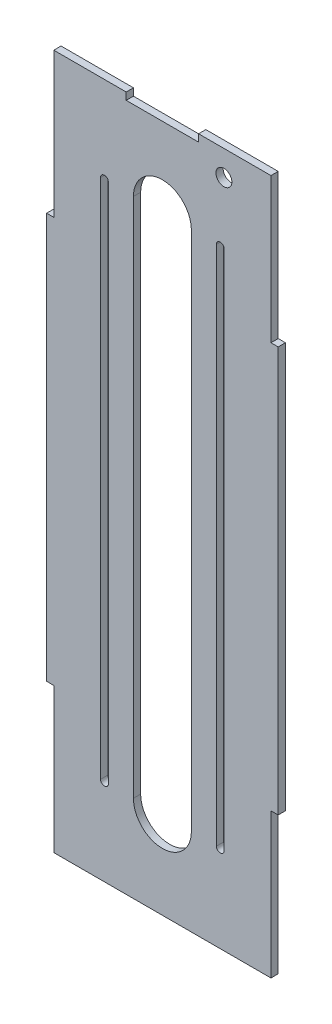
ISO-10303-21;
HEADER;
FILE_DESCRIPTION(('STEP AP214'),'2;1');
FILE_NAME('part.step','',(''),(''),'','','');
FILE_SCHEMA(('AUTOMOTIVE_DESIGN { 1 0 10303 214 1 1 1 1 }'));
ENDSEC;
DATA;
#1=APPLICATION_CONTEXT('core data for automotive mechanical design processes');
#2=APPLICATION_PROTOCOL_DEFINITION('international standard','automotive_design',2000,#1);
#3=PRODUCT_CONTEXT('',#1,'mechanical');
#4=PRODUCT('Part','Part','',(#3));
#5=PRODUCT_RELATED_PRODUCT_CATEGORY('part','',(#4));
#6=PRODUCT_DEFINITION_FORMATION('','',#4);
#7=PRODUCT_DEFINITION_CONTEXT('part definition',#1,'design');
#8=PRODUCT_DEFINITION('design','',#6,#7);
#9=PRODUCT_DEFINITION_SHAPE('','',#8);
#10=(LENGTH_UNIT() NAMED_UNIT(*) SI_UNIT(.MILLI.,.METRE.));
#11=(NAMED_UNIT(*) PLANE_ANGLE_UNIT() SI_UNIT($,.RADIAN.));
#12=(NAMED_UNIT(*) SI_UNIT($,.STERADIAN.) SOLID_ANGLE_UNIT());
#13=UNCERTAINTY_MEASURE_WITH_UNIT(LENGTH_MEASURE(1.E-05),#10,'distance_accuracy_value','');
#14=(GEOMETRIC_REPRESENTATION_CONTEXT(3) GLOBAL_UNCERTAINTY_ASSIGNED_CONTEXT((#13)) GLOBAL_UNIT_ASSIGNED_CONTEXT((#10,
#11,#12)) REPRESENTATION_CONTEXT('',''));
#15=CARTESIAN_POINT('',(0.,0.,0.));
#16=DIRECTION('',(0.,0.,1.));
#17=DIRECTION('',(1.,0.,0.));
#18=AXIS2_PLACEMENT_3D('',#15,#16,#17);
#19=CARTESIAN_POINT('',(0.,0.,6.35));
#20=DIRECTION('',(0.,0.,1.));
#21=DIRECTION('',(1.,0.,0.));
#22=AXIS2_PLACEMENT_3D('',#19,#20,#21);
#23=PLANE('',#22);
#24=CARTESIAN_POINT('',(-857.158491521162,652.784891730796,6.35));
#25=DIRECTION('',(0.,0.,1.));
#26=DIRECTION('',(1.,0.,0.));
#27=AXIS2_PLACEMENT_3D('',#24,#25,#26);
#28=CIRCLE('',#27,6.98500000000007);
#29=CARTESIAN_POINT('',(-850.173491521162,652.784891730796,6.35));
#30=VERTEX_POINT('',#29);
#31=EDGE_CURVE('E239',#30,#30,#28,.T.);
#32=ORIENTED_EDGE('',*,*,#31,.F.);
#33=EDGE_LOOP('',(#32));
#34=FACE_BOUND('',#33,.T.);
#35=CARTESIAN_POINT('',(-961.926767394614,141.508550967699,6.35));
#36=DIRECTION('',(0.,0.,-1.));
#37=DIRECTION('',(-1.,0.,0.));
#38=AXIS2_PLACEMENT_3D('',#35,#36,#37);
#39=CIRCLE('',#38,3.42900000000002);
#40=CARTESIAN_POINT('',(-958.497767394614,141.508550967699,6.35));
#41=VERTEX_POINT('',#40);
#42=CARTESIAN_POINT('',(-965.355767394614,141.508550967699,6.35));
#43=VERTEX_POINT('',#42);
#44=EDGE_CURVE('E256',#41,#43,#39,.T.);
#45=ORIENTED_EDGE('',*,*,#44,.T.);
#46=DIRECTION('',(0.,1.,0.));
#47=VECTOR('',#46,1.);
#48=CARTESIAN_POINT('',(-965.355767394614,141.508550967699,6.35));
#49=LINE('',#48,#47);
#50=CARTESIAN_POINT('',(-965.355767394614,598.708550967699,6.35));
#51=VERTEX_POINT('',#50);
#52=EDGE_CURVE('E259',#43,#51,#49,.T.);
#53=ORIENTED_EDGE('',*,*,#52,.T.);
#54=CARTESIAN_POINT('',(-961.926767394614,598.708550967699,6.35));
#55=DIRECTION('',(0.,0.,-1.));
#56=DIRECTION('',(-1.,0.,0.));
#57=AXIS2_PLACEMENT_3D('',#54,#55,#56);
#58=CIRCLE('',#57,3.42900000000002);
#59=CARTESIAN_POINT('',(-958.497767394614,598.708550967699,6.35));
#60=VERTEX_POINT('',#59);
#61=EDGE_CURVE('E263',#51,#60,#58,.T.);
#62=ORIENTED_EDGE('',*,*,#61,.T.);
#63=DIRECTION('',(0.,1.,0.));
#64=VECTOR('',#63,1.);
#65=CARTESIAN_POINT('',(-958.497767394614,141.508550967699,6.35));
#66=LINE('',#65,#64);
#67=EDGE_CURVE('E266',#41,#60,#66,.T.);
#68=ORIENTED_EDGE('',*,*,#67,.F.);
#69=EDGE_LOOP('',(#45,#53,#62,#68));
#70=FACE_BOUND('',#69,.T.);
#71=CARTESIAN_POINT('',(-911.126767394614,141.508550967699,6.35));
#72=DIRECTION('',(0.,0.,1.));
#73=DIRECTION('',(1.,0.,0.));
#74=AXIS2_PLACEMENT_3D('',#71,#72,#73);
#75=CIRCLE('',#74,25.4);
#76=CARTESIAN_POINT('',(-936.526767394614,141.508550967699,6.35));
#77=VERTEX_POINT('',#76);
#78=CARTESIAN_POINT('',(-885.726767394614,141.508550967699,6.35));
#79=VERTEX_POINT('',#78);
#80=EDGE_CURVE('E366',#77,#79,#75,.T.);
#81=ORIENTED_EDGE('',*,*,#80,.F.);
#82=DIRECTION('',(0.,1.,0.));
#83=VECTOR('',#82,1.);
#84=CARTESIAN_POINT('',(-936.526767394614,141.508550967699,6.35));
#85=LINE('',#84,#83);
#86=CARTESIAN_POINT('',(-936.526767394614,598.708550967699,6.35));
#87=VERTEX_POINT('',#86);
#88=EDGE_CURVE('E371',#77,#87,#85,.T.);
#89=ORIENTED_EDGE('',*,*,#88,.T.);
#90=CARTESIAN_POINT('',(-911.126767394614,598.708550967699,6.35));
#91=DIRECTION('',(0.,0.,1.));
#92=DIRECTION('',(1.,0.,0.));
#93=AXIS2_PLACEMENT_3D('',#90,#91,#92);
#94=CIRCLE('',#93,25.4);
#95=CARTESIAN_POINT('',(-885.726767394614,598.708550967699,6.35));
#96=VERTEX_POINT('',#95);
#97=EDGE_CURVE('E384',#96,#87,#94,.T.);
#98=ORIENTED_EDGE('',*,*,#97,.F.);
#99=DIRECTION('',(0.,1.,0.));
#100=VECTOR('',#99,1.);
#101=CARTESIAN_POINT('',(-885.726767394614,141.508550967699,6.35));
#102=LINE('',#101,#100);
#103=EDGE_CURVE('E381',#79,#96,#102,.T.);
#104=ORIENTED_EDGE('',*,*,#103,.F.);
#105=EDGE_LOOP('',(#81,#89,#98,#104));
#106=FACE_BOUND('',#105,.T.);
#107=DIRECTION('',(-1.,0.,0.));
#108=VECTOR('',#107,1.);
#109=CARTESIAN_POINT('',(-803.176767394614,674.908550967699,6.35));
#110=LINE('',#109,#108);
#111=CARTESIAN_POINT('',(-815.876767394614,674.908550967699,6.35));
#112=VERTEX_POINT('',#111);
#113=CARTESIAN_POINT('',(-879.376767394614,674.908550967699,6.35));
#114=VERTEX_POINT('',#113);
#115=EDGE_CURVE('E402',#112,#114,#110,.T.);
#116=ORIENTED_EDGE('',*,*,#115,.T.);
#117=DIRECTION('',(0.,-1.,0.));
#118=VECTOR('',#117,1.);
#119=CARTESIAN_POINT('',(-879.376767394614,0.,6.35));
#120=LINE('',#119,#118);
#121=CARTESIAN_POINT('',(-879.376767394614,668.558550967699,6.35));
#122=VERTEX_POINT('',#121);
#123=EDGE_CURVE('E301',#114,#122,#120,.T.);
#124=ORIENTED_EDGE('',*,*,#123,.T.);
#125=DIRECTION('',(-1.,0.,0.));
#126=VECTOR('',#125,1.);
#127=CARTESIAN_POINT('',(0.,668.558550967699,6.35));
#128=LINE('',#127,#126);
#129=CARTESIAN_POINT('',(-942.876767394614,668.558550967699,6.35));
#130=VERTEX_POINT('',#129);
#131=EDGE_CURVE('E303',#122,#130,#128,.T.);
#132=ORIENTED_EDGE('',*,*,#131,.T.);
#133=DIRECTION('',(0.,1.,0.));
#134=VECTOR('',#133,1.);
#135=CARTESIAN_POINT('',(-942.876767394614,0.,6.35));
#136=LINE('',#135,#134);
#137=CARTESIAN_POINT('',(-942.876767394614,674.908550967699,6.34999999999997));
#138=VERTEX_POINT('',#137);
#139=EDGE_CURVE('E295',#130,#138,#136,.T.);
#140=ORIENTED_EDGE('',*,*,#139,.T.);
#141=CARTESIAN_POINT('',(-1006.37676739461,674.908550967699,6.34999999999997));
#142=VERTEX_POINT('',#141);
#143=EDGE_CURVE('E400',#138,#142,#110,.T.);
#144=ORIENTED_EDGE('',*,*,#143,.T.);
#145=DIRECTION('',(0.,1.,0.));
#146=VECTOR('',#145,1.);
#147=CARTESIAN_POINT('',(-1006.37676739461,0.,6.35));
#148=LINE('',#147,#146);
#149=CARTESIAN_POINT('',(-1006.37676739461,547.908550967699,6.34999999999997));
#150=VERTEX_POINT('',#149);
#151=EDGE_CURVE('E343',#150,#142,#148,.T.);
#152=ORIENTED_EDGE('',*,*,#151,.F.);
#153=DIRECTION('',(1.,0.,0.));
#154=VECTOR('',#153,1.);
#155=CARTESIAN_POINT('',(0.,547.908550967699,6.35));
#156=LINE('',#155,#154);
#157=CARTESIAN_POINT('',(-1012.72676739461,547.908550967699,6.34999999999997));
#158=VERTEX_POINT('',#157);
#159=EDGE_CURVE('E341',#158,#150,#156,.T.);
#160=ORIENTED_EDGE('',*,*,#159,.F.);
#161=DIRECTION('',(0.,-1.,0.));
#162=VECTOR('',#161,1.);
#163=CARTESIAN_POINT('',(-1012.72676739461,0.,6.35));
#164=LINE('',#163,#162);
#165=CARTESIAN_POINT('',(-1012.72676739461,192.308550967699,6.34999999999997));
#166=VERTEX_POINT('',#165);
#167=EDGE_CURVE('E317',#158,#166,#164,.T.);
#168=ORIENTED_EDGE('',*,*,#167,.T.);
#169=DIRECTION('',(1.,0.,0.));
#170=VECTOR('',#169,1.);
#171=CARTESIAN_POINT('',(0.,192.308550967699,6.35));
#172=LINE('',#171,#170);
#173=CARTESIAN_POINT('',(-1006.37676739461,192.308550967699,6.35));
#174=VERTEX_POINT('',#173);
#175=EDGE_CURVE('E331',#166,#174,#172,.T.);
#176=ORIENTED_EDGE('',*,*,#175,.T.);
#177=DIRECTION('',(0.,-1.,0.));
#178=VECTOR('',#177,1.);
#179=CARTESIAN_POINT('',(-1006.37676739461,0.,6.35));
#180=LINE('',#179,#178);
#181=CARTESIAN_POINT('',(-1006.37676739461,65.3085509676989,6.34999999999997));
#182=VERTEX_POINT('',#181);
#183=EDGE_CURVE('E326',#174,#182,#180,.T.);
#184=ORIENTED_EDGE('',*,*,#183,.T.);
#185=DIRECTION('',(1.,0.,0.));
#186=VECTOR('',#185,1.);
#187=CARTESIAN_POINT('',(-803.176767394614,65.3085509676989,6.35));
#188=LINE('',#187,#186);
#189=CARTESIAN_POINT('',(-815.876767394614,65.3085509676989,6.35));
#190=VERTEX_POINT('',#189);
#191=EDGE_CURVE('E398',#182,#190,#188,.T.);
#192=ORIENTED_EDGE('',*,*,#191,.T.);
#193=DIRECTION('',(0.,-1.,0.));
#194=VECTOR('',#193,1.);
#195=CARTESIAN_POINT('',(-815.876767394614,0.,6.35));
#196=LINE('',#195,#194);
#197=CARTESIAN_POINT('',(-815.876767394614,192.308550967699,6.34999999999997));
#198=VERTEX_POINT('',#197);
#199=EDGE_CURVE('E352',#198,#190,#196,.T.);
#200=ORIENTED_EDGE('',*,*,#199,.F.);
#201=DIRECTION('',(-1.,0.,0.));
#202=VECTOR('',#201,1.);
#203=CARTESIAN_POINT('',(4.20286183300467E-13,192.308550967697,6.35));
#204=LINE('',#203,#202);
#205=CARTESIAN_POINT('',(-809.526767394614,192.308550967699,6.35));
#206=VERTEX_POINT('',#205);
#207=EDGE_CURVE('E355',#206,#198,#204,.T.);
#208=ORIENTED_EDGE('',*,*,#207,.F.);
#209=DIRECTION('',(0.,-1.,0.));
#210=VECTOR('',#209,1.);
#211=CARTESIAN_POINT('',(-809.526767394614,0.,6.35));
#212=LINE('',#211,#210);
#213=CARTESIAN_POINT('',(-809.526767394614,547.908550967699,6.34999999999997));
#214=VERTEX_POINT('',#213);
#215=EDGE_CURVE('E311',#214,#206,#212,.T.);
#216=ORIENTED_EDGE('',*,*,#215,.F.);
#217=DIRECTION('',(-1.,0.,0.));
#218=VECTOR('',#217,1.);
#219=CARTESIAN_POINT('',(0.,547.908550967699,6.35));
#220=LINE('',#219,#218);
#221=CARTESIAN_POINT('',(-815.876767394614,547.908550967699,6.35));
#222=VERTEX_POINT('',#221);
#223=EDGE_CURVE('E362',#214,#222,#220,.T.);
#224=ORIENTED_EDGE('',*,*,#223,.T.);
#225=DIRECTION('',(0.,1.,0.));
#226=VECTOR('',#225,1.);
#227=CARTESIAN_POINT('',(-815.876767394614,0.,6.35));
#228=LINE('',#227,#226);
#229=EDGE_CURVE('E364',#222,#112,#228,.T.);
#230=ORIENTED_EDGE('',*,*,#229,.T.);
#231=EDGE_LOOP('',(#116,#124,#132,#140,#144,#152,#160,#168,#176,#184,#192,#200,#208,#216,#224,#230));
#232=FACE_BOUND('',#231,.T.);
#233=DIRECTION('',(0.,1.,0.));
#234=VECTOR('',#233,1.);
#235=CARTESIAN_POINT('',(-856.897767394614,141.508550967699,6.35));
#236=LINE('',#235,#234);
#237=CARTESIAN_POINT('',(-856.897767394614,141.508550967699,6.35));
#238=VERTEX_POINT('',#237);
#239=CARTESIAN_POINT('',(-856.897767394614,598.708550967699,6.35));
#240=VERTEX_POINT('',#239);
#241=EDGE_CURVE('E223',#238,#240,#236,.T.);
#242=ORIENTED_EDGE('',*,*,#241,.F.);
#243=CARTESIAN_POINT('',(-860.326767394614,141.508550967699,6.35));
#244=DIRECTION('',(0.,0.,1.));
#245=DIRECTION('',(1.,0.,0.));
#246=AXIS2_PLACEMENT_3D('',#243,#244,#245);
#247=CIRCLE('',#246,3.42900000000002);
#248=CARTESIAN_POINT('',(-863.755767394614,141.508550967699,6.35));
#249=VERTEX_POINT('',#248);
#250=EDGE_CURVE('E220',#249,#238,#247,.T.);
#251=ORIENTED_EDGE('',*,*,#250,.F.);
#252=DIRECTION('',(0.,1.,0.));
#253=VECTOR('',#252,1.);
#254=CARTESIAN_POINT('',(-863.755767394614,141.508550967699,6.35));
#255=LINE('',#254,#253);
#256=CARTESIAN_POINT('',(-863.755767394615,598.708550967699,6.35));
#257=VERTEX_POINT('',#256);
#258=EDGE_CURVE('E226',#249,#257,#255,.T.);
#259=ORIENTED_EDGE('',*,*,#258,.T.);
#260=CARTESIAN_POINT('',(-860.326767394614,598.708550967699,6.35));
#261=DIRECTION('',(0.,0.,1.));
#262=DIRECTION('',(1.,0.,0.));
#263=AXIS2_PLACEMENT_3D('',#260,#261,#262);
#264=CIRCLE('',#263,3.42900000000002);
#265=EDGE_CURVE('E230',#240,#257,#264,.T.);
#266=ORIENTED_EDGE('',*,*,#265,.F.);
#267=EDGE_LOOP('',(#242,#251,#259,#266));
#268=FACE_BOUND('',#267,.T.);
#269=ADVANCED_FACE('F33',(#34,#70,#106,#232,#268),#23,.T.);
#270=CARTESIAN_POINT('',(0.,0.,0.));
#271=DIRECTION('',(0.,0.,1.));
#272=DIRECTION('',(1.,0.,0.));
#273=AXIS2_PLACEMENT_3D('',#270,#271,#272);
#274=PLANE('',#273);
#275=CARTESIAN_POINT('',(-857.158491521162,652.784891730796,0.));
#276=DIRECTION('',(0.,0.,1.));
#277=DIRECTION('',(1.,0.,0.));
#278=AXIS2_PLACEMENT_3D('',#275,#276,#277);
#279=CIRCLE('',#278,6.98500000000007);
#280=CARTESIAN_POINT('',(-850.173491521162,652.784891730796,0.));
#281=VERTEX_POINT('',#280);
#282=EDGE_CURVE('E246',#281,#281,#279,.T.);
#283=ORIENTED_EDGE('',*,*,#282,.T.);
#284=EDGE_LOOP('',(#283));
#285=FACE_BOUND('',#284,.T.);
#286=DIRECTION('',(0.,-1.,0.));
#287=VECTOR('',#286,1.);
#288=CARTESIAN_POINT('',(-879.376767394614,0.,0.));
#289=LINE('',#288,#287);
#290=CARTESIAN_POINT('',(-879.376767394614,674.908550967699,0.));
#291=VERTEX_POINT('',#290);
#292=CARTESIAN_POINT('',(-879.376767394614,668.558550967699,0.));
#293=VERTEX_POINT('',#292);
#294=EDGE_CURVE('E298',#291,#293,#289,.T.);
#295=ORIENTED_EDGE('',*,*,#294,.F.);
#296=DIRECTION('',(-1.,0.,0.));
#297=VECTOR('',#296,1.);
#298=CARTESIAN_POINT('',(-803.176767394614,674.908550967699,0.));
#299=LINE('',#298,#297);
#300=CARTESIAN_POINT('',(-815.876767394614,674.908550967699,0.));
#301=VERTEX_POINT('',#300);
#302=EDGE_CURVE('E401',#301,#291,#299,.T.);
#303=ORIENTED_EDGE('',*,*,#302,.F.);
#304=DIRECTION('',(0.,1.,0.));
#305=VECTOR('',#304,1.);
#306=CARTESIAN_POINT('',(-815.876767394614,0.,0.));
#307=LINE('',#306,#305);
#308=CARTESIAN_POINT('',(-815.876767394614,547.908550967699,0.));
#309=VERTEX_POINT('',#308);
#310=EDGE_CURVE('E411',#309,#301,#307,.T.);
#311=ORIENTED_EDGE('',*,*,#310,.F.);
#312=DIRECTION('',(-1.,0.,0.));
#313=VECTOR('',#312,1.);
#314=CARTESIAN_POINT('',(0.,547.908550967699,0.));
#315=LINE('',#314,#313);
#316=CARTESIAN_POINT('',(-809.526767394614,547.908550967699,0.));
#317=VERTEX_POINT('',#316);
#318=EDGE_CURVE('E405',#317,#309,#315,.T.);
#319=ORIENTED_EDGE('',*,*,#318,.F.);
#320=DIRECTION('',(0.,-1.,0.));
#321=VECTOR('',#320,1.);
#322=CARTESIAN_POINT('',(-809.526767394614,0.,0.));
#323=LINE('',#322,#321);
#324=CARTESIAN_POINT('',(-809.526767394614,192.308550967699,0.));
#325=VERTEX_POINT('',#324);
#326=EDGE_CURVE('E308',#317,#325,#323,.T.);
#327=ORIENTED_EDGE('',*,*,#326,.T.);
#328=DIRECTION('',(-1.,0.,0.));
#329=VECTOR('',#328,1.);
#330=CARTESIAN_POINT('',(4.20286183300467E-13,192.308550967697,0.));
#331=LINE('',#330,#329);
#332=CARTESIAN_POINT('',(-815.876767394614,192.308550967699,0.));
#333=VERTEX_POINT('',#332);
#334=EDGE_CURVE('E417',#325,#333,#331,.T.);
#335=ORIENTED_EDGE('',*,*,#334,.T.);
#336=DIRECTION('',(0.,-1.,0.));
#337=VECTOR('',#336,1.);
#338=CARTESIAN_POINT('',(-815.876767394614,0.,0.));
#339=LINE('',#338,#337);
#340=CARTESIAN_POINT('',(-815.876767394614,65.3085509676989,0.));
#341=VERTEX_POINT('',#340);
#342=EDGE_CURVE('E349',#333,#341,#339,.T.);
#343=ORIENTED_EDGE('',*,*,#342,.T.);
#344=DIRECTION('',(1.,0.,0.));
#345=VECTOR('',#344,1.);
#346=CARTESIAN_POINT('',(-803.176767394614,65.3085509676989,0.));
#347=LINE('',#346,#345);
#348=CARTESIAN_POINT('',(-1006.37676739461,65.3085509676989,0.));
#349=VERTEX_POINT('',#348);
#350=EDGE_CURVE('E391',#349,#341,#347,.T.);
#351=ORIENTED_EDGE('',*,*,#350,.F.);
#352=DIRECTION('',(0.,-1.,0.));
#353=VECTOR('',#352,1.);
#354=CARTESIAN_POINT('',(-1006.37676739461,0.,0.));
#355=LINE('',#354,#353);
#356=CARTESIAN_POINT('',(-1006.37676739461,192.308550967699,0.));
#357=VERTEX_POINT('',#356);
#358=EDGE_CURVE('E323',#357,#349,#355,.T.);
#359=ORIENTED_EDGE('',*,*,#358,.F.);
#360=DIRECTION('',(1.,0.,0.));
#361=VECTOR('',#360,1.);
#362=CARTESIAN_POINT('',(0.,192.308550967699,0.));
#363=LINE('',#362,#361);
#364=CARTESIAN_POINT('',(-1012.72676739461,192.308550967699,0.));
#365=VERTEX_POINT('',#364);
#366=EDGE_CURVE('E329',#365,#357,#363,.T.);
#367=ORIENTED_EDGE('',*,*,#366,.F.);
#368=DIRECTION('',(0.,-1.,0.));
#369=VECTOR('',#368,1.);
#370=CARTESIAN_POINT('',(-1012.72676739461,0.,0.));
#371=LINE('',#370,#369);
#372=CARTESIAN_POINT('',(-1012.72676739461,547.908550967699,0.));
#373=VERTEX_POINT('',#372);
#374=EDGE_CURVE('E315',#373,#365,#371,.T.);
#375=ORIENTED_EDGE('',*,*,#374,.F.);
#376=DIRECTION('',(1.,0.,0.));
#377=VECTOR('',#376,1.);
#378=CARTESIAN_POINT('',(0.,547.908550967699,0.));
#379=LINE('',#378,#377);
#380=CARTESIAN_POINT('',(-1006.37676739461,547.908550967699,0.));
#381=VERTEX_POINT('',#380);
#382=EDGE_CURVE('E339',#373,#381,#379,.T.);
#383=ORIENTED_EDGE('',*,*,#382,.T.);
#384=DIRECTION('',(0.,1.,0.));
#385=VECTOR('',#384,1.);
#386=CARTESIAN_POINT('',(-1006.37676739461,0.,0.));
#387=LINE('',#386,#385);
#388=CARTESIAN_POINT('',(-1006.37676739461,674.908550967699,0.));
#389=VERTEX_POINT('',#388);
#390=EDGE_CURVE('E419',#381,#389,#387,.T.);
#391=ORIENTED_EDGE('',*,*,#390,.T.);
#392=CARTESIAN_POINT('',(-942.876767394614,674.908550967699,0.));
#393=VERTEX_POINT('',#392);
#394=EDGE_CURVE('E407',#393,#389,#299,.T.);
#395=ORIENTED_EDGE('',*,*,#394,.F.);
#396=DIRECTION('',(0.,1.,0.));
#397=VECTOR('',#396,1.);
#398=CARTESIAN_POINT('',(-942.876767394614,0.,0.));
#399=LINE('',#398,#397);
#400=CARTESIAN_POINT('',(-942.876767394614,668.558550967699,0.));
#401=VERTEX_POINT('',#400);
#402=EDGE_CURVE('E292',#401,#393,#399,.T.);
#403=ORIENTED_EDGE('',*,*,#402,.F.);
#404=DIRECTION('',(-1.,0.,0.));
#405=VECTOR('',#404,1.);
#406=CARTESIAN_POINT('',(0.,668.558550967699,0.));
#407=LINE('',#406,#405);
#408=EDGE_CURVE('E11',#293,#401,#407,.T.);
#409=ORIENTED_EDGE('',*,*,#408,.F.);
#410=EDGE_LOOP('',(#295,#303,#311,#319,#327,#335,#343,#351,#359,#367,#375,#383,#391,#395,#403,#409));
#411=FACE_BOUND('',#410,.T.);
#412=DIRECTION('',(0.,1.,0.));
#413=VECTOR('',#412,1.);
#414=CARTESIAN_POINT('',(-936.526767394614,141.508550967699,0.));
#415=LINE('',#414,#413);
#416=CARTESIAN_POINT('',(-936.526767394614,141.508550967699,0.));
#417=VERTEX_POINT('',#416);
#418=CARTESIAN_POINT('',(-936.526767394614,598.708550967699,0.));
#419=VERTEX_POINT('',#418);
#420=EDGE_CURVE('E377',#417,#419,#415,.T.);
#421=ORIENTED_EDGE('',*,*,#420,.F.);
#422=CARTESIAN_POINT('',(-911.126767394614,141.508550967699,0.));
#423=DIRECTION('',(0.,0.,1.));
#424=DIRECTION('',(1.,0.,0.));
#425=AXIS2_PLACEMENT_3D('',#422,#423,#424);
#426=CIRCLE('',#425,25.4);
#427=CARTESIAN_POINT('',(-885.726767394614,141.508550967699,0.));
#428=VERTEX_POINT('',#427);
#429=EDGE_CURVE('E367',#417,#428,#426,.T.);
#430=ORIENTED_EDGE('',*,*,#429,.T.);
#431=DIRECTION('',(0.,1.,0.));
#432=VECTOR('',#431,1.);
#433=CARTESIAN_POINT('',(-885.726767394614,141.508550967699,0.));
#434=LINE('',#433,#432);
#435=CARTESIAN_POINT('',(-885.726767394614,598.708550967699,0.));
#436=VERTEX_POINT('',#435);
#437=EDGE_CURVE('E370',#428,#436,#434,.T.);
#438=ORIENTED_EDGE('',*,*,#437,.T.);
#439=CARTESIAN_POINT('',(-911.126767394614,598.708550967699,0.));
#440=DIRECTION('',(0.,0.,1.));
#441=DIRECTION('',(1.,0.,0.));
#442=AXIS2_PLACEMENT_3D('',#439,#440,#441);
#443=CIRCLE('',#442,25.4);
#444=EDGE_CURVE('E374',#436,#419,#443,.T.);
#445=ORIENTED_EDGE('',*,*,#444,.T.);
#446=EDGE_LOOP('',(#421,#430,#438,#445));
#447=FACE_BOUND('',#446,.T.);
#448=DIRECTION('',(0.,1.,0.));
#449=VECTOR('',#448,1.);
#450=CARTESIAN_POINT('',(-965.355767394614,141.508550967699,0.));
#451=LINE('',#450,#449);
#452=CARTESIAN_POINT('',(-965.355767394614,141.508550967699,0.));
#453=VERTEX_POINT('',#452);
#454=CARTESIAN_POINT('',(-965.355767394614,598.708550967699,0.));
#455=VERTEX_POINT('',#454);
#456=EDGE_CURVE('E270',#453,#455,#451,.T.);
#457=ORIENTED_EDGE('',*,*,#456,.F.);
#458=CARTESIAN_POINT('',(-961.926767394614,141.508550967699,0.));
#459=DIRECTION('',(0.,0.,-1.));
#460=DIRECTION('',(-1.,0.,0.));
#461=AXIS2_PLACEMENT_3D('',#458,#459,#460);
#462=CIRCLE('',#461,3.42900000000002);
#463=CARTESIAN_POINT('',(-958.497767394614,141.508550967699,0.));
#464=VERTEX_POINT('',#463);
#465=EDGE_CURVE('E252',#464,#453,#462,.T.);
#466=ORIENTED_EDGE('',*,*,#465,.F.);
#467=DIRECTION('',(0.,1.,0.));
#468=VECTOR('',#467,1.);
#469=CARTESIAN_POINT('',(-958.497767394614,141.508550967699,0.));
#470=LINE('',#469,#468);
#471=CARTESIAN_POINT('',(-958.497767394614,598.708550967699,0.));
#472=VERTEX_POINT('',#471);
#473=EDGE_CURVE('E260',#464,#472,#470,.T.);
#474=ORIENTED_EDGE('',*,*,#473,.T.);
#475=CARTESIAN_POINT('',(-961.926767394614,598.708550967699,0.));
#476=DIRECTION('',(0.,0.,-1.));
#477=DIRECTION('',(-1.,0.,0.));
#478=AXIS2_PLACEMENT_3D('',#475,#476,#477);
#479=CIRCLE('',#478,3.42900000000002);
#480=EDGE_CURVE('E273',#455,#472,#479,.T.);
#481=ORIENTED_EDGE('',*,*,#480,.F.);
#482=EDGE_LOOP('',(#457,#466,#474,#481));
#483=FACE_BOUND('',#482,.T.);
#484=CARTESIAN_POINT('',(-860.326767394614,141.508550967699,0.));
#485=DIRECTION('',(0.,0.,1.));
#486=DIRECTION('',(1.,0.,0.));
#487=AXIS2_PLACEMENT_3D('',#484,#485,#486);
#488=CIRCLE('',#487,3.42900000000002);
#489=CARTESIAN_POINT('',(-863.755767394614,141.508550967699,0.));
#490=VERTEX_POINT('',#489);
#491=CARTESIAN_POINT('',(-856.897767394614,141.508550967699,0.));
#492=VERTEX_POINT('',#491);
#493=EDGE_CURVE('E56',#490,#492,#488,.T.);
#494=ORIENTED_EDGE('',*,*,#493,.T.);
#495=DIRECTION('',(0.,1.,0.));
#496=VECTOR('',#495,1.);
#497=CARTESIAN_POINT('',(-856.897767394614,141.508550967699,0.));
#498=LINE('',#497,#496);
#499=CARTESIAN_POINT('',(-856.897767394614,598.708550967699,0.));
#500=VERTEX_POINT('',#499);
#501=EDGE_CURVE('E233',#492,#500,#498,.T.);
#502=ORIENTED_EDGE('',*,*,#501,.T.);
#503=CARTESIAN_POINT('',(-860.326767394614,598.708550967699,0.));
#504=DIRECTION('',(0.,0.,1.));
#505=DIRECTION('',(1.,0.,0.));
#506=AXIS2_PLACEMENT_3D('',#503,#504,#505);
#507=CIRCLE('',#506,3.42900000000002);
#508=CARTESIAN_POINT('',(-863.755767394615,598.708550967699,0.));
#509=VERTEX_POINT('',#508);
#510=EDGE_CURVE('E236',#500,#509,#507,.T.);
#511=ORIENTED_EDGE('',*,*,#510,.T.);
#512=DIRECTION('',(0.,1.,0.));
#513=VECTOR('',#512,1.);
#514=CARTESIAN_POINT('',(-863.755767394614,141.508550967699,0.));
#515=LINE('',#514,#513);
#516=EDGE_CURVE('E245',#490,#509,#515,.T.);
#517=ORIENTED_EDGE('',*,*,#516,.F.);
#518=EDGE_LOOP('',(#494,#502,#511,#517));
#519=FACE_BOUND('',#518,.T.);
#520=ADVANCED_FACE('F456',(#285,#411,#447,#483,#519),#274,.F.);
#521=CARTESIAN_POINT('',(-803.176767394614,674.908550967699,6.35));
#522=DIRECTION('',(0.,-1.,0.));
#523=DIRECTION('',(0.,0.,-1.));
#524=AXIS2_PLACEMENT_3D('',#521,#522,#523);
#525=PLANE('',#524);
#526=DIRECTION('',(0.,0.,-1.));
#527=VECTOR('',#526,1.);
#528=CARTESIAN_POINT('',(-879.376767394614,674.908550967699,6.35));
#529=LINE('',#528,#527);
#530=EDGE_CURVE('E41',#114,#291,#529,.T.);
#531=ORIENTED_EDGE('',*,*,#530,.F.);
#532=ORIENTED_EDGE('',*,*,#115,.F.);
#533=DIRECTION('',(0.,0.,-1.));
#534=VECTOR('',#533,1.);
#535=CARTESIAN_POINT('',(-815.876767394614,674.908550967699,822.705411436437));
#536=LINE('',#535,#534);
#537=EDGE_CURVE('E360',#112,#301,#536,.T.);
#538=ORIENTED_EDGE('',*,*,#537,.T.);
#539=ORIENTED_EDGE('',*,*,#302,.T.);
#540=EDGE_LOOP('',(#531,#532,#538,#539));
#541=FACE_BOUND('',#540,.T.);
#542=ADVANCED_FACE('F440',(#541),#525,.F.);
#543=DIRECTION('',(0.,0.,1.));
#544=VECTOR('',#543,1.);
#545=CARTESIAN_POINT('',(-942.876767394614,674.908550967699,6.35));
#546=LINE('',#545,#544);
#547=EDGE_CURVE('E431',#393,#138,#546,.T.);
#548=ORIENTED_EDGE('',*,*,#547,.F.);
#549=ORIENTED_EDGE('',*,*,#394,.T.);
#550=DIRECTION('',(0.,0.,-1.));
#551=VECTOR('',#550,1.);
#552=CARTESIAN_POINT('',(-1006.37676739461,674.908550967699,814.767911436436));
#553=LINE('',#552,#551);
#554=EDGE_CURVE('E336',#142,#389,#553,.T.);
#555=ORIENTED_EDGE('',*,*,#554,.F.);
#556=ORIENTED_EDGE('',*,*,#143,.F.);
#557=EDGE_LOOP('',(#548,#549,#555,#556));
#558=FACE_BOUND('',#557,.T.);
#559=ADVANCED_FACE('F473',(#558),#525,.F.);
#560=CARTESIAN_POINT('',(-1006.37676739461,547.908550967699,814.767911436436));
#561=DIRECTION('',(0.,-1.,0.));
#562=DIRECTION('',(0.,0.,-1.));
#563=AXIS2_PLACEMENT_3D('',#560,#561,#562);
#564=PLANE('',#563);
#565=DIRECTION('',(0.,0.,-1.));
#566=VECTOR('',#565,1.);
#567=CARTESIAN_POINT('',(-1012.72676739461,547.908550967699,814.767911436436));
#568=LINE('',#567,#566);
#569=EDGE_CURVE('E313',#158,#373,#568,.T.);
#570=ORIENTED_EDGE('',*,*,#569,.F.);
#571=ORIENTED_EDGE('',*,*,#159,.T.);
#572=DIRECTION('',(0.,0.,-1.));
#573=VECTOR('',#572,1.);
#574=CARTESIAN_POINT('',(-1006.37676739461,547.908550967699,814.767911436436));
#575=LINE('',#574,#573);
#576=EDGE_CURVE('E333',#150,#381,#575,.T.);
#577=ORIENTED_EDGE('',*,*,#576,.T.);
#578=ORIENTED_EDGE('',*,*,#382,.F.);
#579=EDGE_LOOP('',(#570,#571,#577,#578));
#580=FACE_BOUND('',#579,.T.);
#581=ADVANCED_FACE('F478',(#580),#564,.F.);
#582=CARTESIAN_POINT('',(-1006.37676739461,192.308550967699,814.767911436436));
#583=DIRECTION('',(0.,-1.,0.));
#584=DIRECTION('',(0.,0.,-1.));
#585=AXIS2_PLACEMENT_3D('',#582,#583,#584);
#586=PLANE('',#585);
#587=ORIENTED_EDGE('',*,*,#175,.F.);
#588=DIRECTION('',(0.,0.,-1.));
#589=VECTOR('',#588,1.);
#590=CARTESIAN_POINT('',(-1012.72676739461,192.308550967699,814.767911436436));
#591=LINE('',#590,#589);
#592=EDGE_CURVE('E425',#166,#365,#591,.T.);
#593=ORIENTED_EDGE('',*,*,#592,.T.);
#594=ORIENTED_EDGE('',*,*,#366,.T.);
#595=DIRECTION('',(0.,0.,-1.));
#596=VECTOR('',#595,1.);
#597=CARTESIAN_POINT('',(-1006.37676739461,192.308550967699,814.767911436436));
#598=LINE('',#597,#596);
#599=EDGE_CURVE('E320',#174,#357,#598,.T.);
#600=ORIENTED_EDGE('',*,*,#599,.F.);
#601=EDGE_LOOP('',(#587,#593,#594,#600));
#602=FACE_BOUND('',#601,.T.);
#603=ADVANCED_FACE('F484',(#602),#586,.T.);
#604=CARTESIAN_POINT('',(-803.176767394614,65.3085509676989,6.35));
#605=DIRECTION('',(0.,1.,0.));
#606=DIRECTION('',(0.,0.,1.));
#607=AXIS2_PLACEMENT_3D('',#604,#605,#606);
#608=PLANE('',#607);
#609=DIRECTION('',(0.,0.,1.));
#610=VECTOR('',#609,1.);
#611=CARTESIAN_POINT('',(-1006.37676739461,65.3085509676989,6.35));
#612=LINE('',#611,#610);
#613=EDGE_CURVE('E422',#349,#182,#612,.T.);
#614=ORIENTED_EDGE('',*,*,#613,.F.);
#615=ORIENTED_EDGE('',*,*,#350,.T.);
#616=DIRECTION('',(0.,0.,1.));
#617=VECTOR('',#616,1.);
#618=CARTESIAN_POINT('',(-815.876767394614,65.3085509676989,6.35));
#619=LINE('',#618,#617);
#620=EDGE_CURVE('E414',#341,#190,#619,.T.);
#621=ORIENTED_EDGE('',*,*,#620,.T.);
#622=ORIENTED_EDGE('',*,*,#191,.F.);
#623=EDGE_LOOP('',(#614,#615,#621,#622));
#624=FACE_BOUND('',#623,.T.);
#625=ADVANCED_FACE('F35',(#624),#608,.F.);
#626=CARTESIAN_POINT('',(-911.126767394614,141.508550967699,0.));
#627=DIRECTION('',(0.,0.,1.));
#628=DIRECTION('',(1.,0.,0.));
#629=AXIS2_PLACEMENT_3D('',#626,#627,#628);
#630=CYLINDRICAL_SURFACE('',#629,25.4);
#631=ORIENTED_EDGE('',*,*,#80,.T.);
#632=DIRECTION('',(0.,0.,1.));
#633=VECTOR('',#632,1.);
#634=CARTESIAN_POINT('',(-885.726767394614,141.508550967699,0.));
#635=LINE('',#634,#633);
#636=EDGE_CURVE('E379',#428,#79,#635,.T.);
#637=ORIENTED_EDGE('',*,*,#636,.F.);
#638=ORIENTED_EDGE('',*,*,#429,.F.);
#639=DIRECTION('',(0.,0.,1.));
#640=VECTOR('',#639,1.);
#641=CARTESIAN_POINT('',(-936.526767394614,141.508550967699,0.));
#642=LINE('',#641,#640);
#643=EDGE_CURVE('E389',#417,#77,#642,.T.);
#644=ORIENTED_EDGE('',*,*,#643,.T.);
#645=EDGE_LOOP('',(#631,#637,#638,#644));
#646=FACE_BOUND('',#645,.T.);
#647=ADVANCED_FACE('F525',(#646),#630,.F.);
#648=CARTESIAN_POINT('',(-936.526767394614,141.508550967699,0.));
#649=DIRECTION('',(1.,0.,0.));
#650=DIRECTION('',(0.,1.,0.));
#651=AXIS2_PLACEMENT_3D('',#648,#649,#650);
#652=PLANE('',#651);
#653=ORIENTED_EDGE('',*,*,#88,.F.);
#654=ORIENTED_EDGE('',*,*,#643,.F.);
#655=ORIENTED_EDGE('',*,*,#420,.T.);
#656=DIRECTION('',(0.,0.,1.));
#657=VECTOR('',#656,1.);
#658=CARTESIAN_POINT('',(-936.526767394614,598.708550967699,0.));
#659=LINE('',#658,#657);
#660=EDGE_CURVE('E392',#419,#87,#659,.T.);
#661=ORIENTED_EDGE('',*,*,#660,.T.);
#662=EDGE_LOOP('',(#653,#654,#655,#661));
#663=FACE_BOUND('',#662,.T.);
#664=ADVANCED_FACE('F554',(#663),#652,.T.);
#665=CARTESIAN_POINT('',(-911.126767394614,598.708550967699,0.));
#666=DIRECTION('',(0.,0.,1.));
#667=DIRECTION('',(1.,0.,0.));
#668=AXIS2_PLACEMENT_3D('',#665,#666,#667);
#669=CYLINDRICAL_SURFACE('',#668,25.4);
#670=ORIENTED_EDGE('',*,*,#97,.T.);
#671=ORIENTED_EDGE('',*,*,#660,.F.);
#672=ORIENTED_EDGE('',*,*,#444,.F.);
#673=DIRECTION('',(0.,0.,1.));
#674=VECTOR('',#673,1.);
#675=CARTESIAN_POINT('',(-885.726767394614,598.708550967699,0.));
#676=LINE('',#675,#674);
#677=EDGE_CURVE('E394',#436,#96,#676,.T.);
#678=ORIENTED_EDGE('',*,*,#677,.T.);
#679=EDGE_LOOP('',(#670,#671,#672,#678));
#680=FACE_BOUND('',#679,.T.);
#681=ADVANCED_FACE('F557',(#680),#669,.F.);
#682=CARTESIAN_POINT('',(-885.726767394614,141.508550967699,0.));
#683=DIRECTION('',(1.,0.,0.));
#684=DIRECTION('',(0.,1.,0.));
#685=AXIS2_PLACEMENT_3D('',#682,#683,#684);
#686=PLANE('',#685);
#687=ORIENTED_EDGE('',*,*,#103,.T.);
#688=ORIENTED_EDGE('',*,*,#677,.F.);
#689=ORIENTED_EDGE('',*,*,#437,.F.);
#690=ORIENTED_EDGE('',*,*,#636,.T.);
#691=EDGE_LOOP('',(#687,#688,#689,#690));
#692=FACE_BOUND('',#691,.T.);
#693=ADVANCED_FACE('F553',(#692),#686,.F.);
#694=CARTESIAN_POINT('',(-815.876767394614,674.908550967699,822.705411436437));
#695=DIRECTION('',(1.,0.,0.));
#696=DIRECTION('',(0.,0.,-1.));
#697=AXIS2_PLACEMENT_3D('',#694,#695,#696);
#698=PLANE('',#697);
#699=ORIENTED_EDGE('',*,*,#229,.F.);
#700=DIRECTION('',(0.,0.,-1.));
#701=VECTOR('',#700,1.);
#702=CARTESIAN_POINT('',(-815.876767394614,547.908550967699,822.705411436437));
#703=LINE('',#702,#701);
#704=EDGE_CURVE('E357',#222,#309,#703,.T.);
#705=ORIENTED_EDGE('',*,*,#704,.T.);
#706=ORIENTED_EDGE('',*,*,#310,.T.);
#707=ORIENTED_EDGE('',*,*,#537,.F.);
#708=EDGE_LOOP('',(#699,#705,#706,#707));
#709=FACE_BOUND('',#708,.T.);
#710=ADVANCED_FACE('F450',(#709),#698,.T.);
#711=CARTESIAN_POINT('',(-815.876767394614,547.908550967699,822.705411436437));
#712=DIRECTION('',(0.,1.,0.));
#713=DIRECTION('',(0.,0.,1.));
#714=AXIS2_PLACEMENT_3D('',#711,#712,#713);
#715=PLANE('',#714);
#716=DIRECTION('',(0.,0.,-1.));
#717=VECTOR('',#716,1.);
#718=CARTESIAN_POINT('',(-809.526767394614,547.908550967699,812.152865353866));
#719=LINE('',#718,#717);
#720=EDGE_CURVE('E305',#214,#317,#719,.T.);
#721=ORIENTED_EDGE('',*,*,#720,.T.);
#722=ORIENTED_EDGE('',*,*,#318,.T.);
#723=ORIENTED_EDGE('',*,*,#704,.F.);
#724=ORIENTED_EDGE('',*,*,#223,.F.);
#725=EDGE_LOOP('',(#721,#722,#723,#724));
#726=FACE_BOUND('',#725,.T.);
#727=ADVANCED_FACE('F452',(#726),#715,.T.);
#728=CARTESIAN_POINT('',(-815.876767394614,192.308550967699,814.767911436436));
#729=DIRECTION('',(0.,1.,0.));
#730=DIRECTION('',(-1.,0.,0.));
#731=AXIS2_PLACEMENT_3D('',#728,#729,#730);
#732=PLANE('',#731);
#733=ORIENTED_EDGE('',*,*,#334,.F.);
#734=DIRECTION('',(0.,0.,1.));
#735=VECTOR('',#734,1.);
#736=CARTESIAN_POINT('',(-809.526767394614,192.308550967699,814.767911436436));
#737=LINE('',#736,#735);
#738=EDGE_CURVE('E428',#325,#206,#737,.T.);
#739=ORIENTED_EDGE('',*,*,#738,.T.);
#740=ORIENTED_EDGE('',*,*,#207,.T.);
#741=DIRECTION('',(0.,0.,-1.));
#742=VECTOR('',#741,1.);
#743=CARTESIAN_POINT('',(-815.876767394614,192.308550967699,814.767911436436));
#744=LINE('',#743,#742);
#745=EDGE_CURVE('E346',#198,#333,#744,.T.);
#746=ORIENTED_EDGE('',*,*,#745,.T.);
#747=EDGE_LOOP('',(#733,#739,#740,#746));
#748=FACE_BOUND('',#747,.T.);
#749=ADVANCED_FACE('F500',(#748),#732,.F.);
#750=CARTESIAN_POINT('',(-815.876767394614,65.3085509676989,814.767911436436));
#751=DIRECTION('',(-1.,0.,0.));
#752=DIRECTION('',(0.,0.,1.));
#753=AXIS2_PLACEMENT_3D('',#750,#751,#752);
#754=PLANE('',#753);
#755=ORIENTED_EDGE('',*,*,#745,.F.);
#756=ORIENTED_EDGE('',*,*,#199,.T.);
#757=ORIENTED_EDGE('',*,*,#620,.F.);
#758=ORIENTED_EDGE('',*,*,#342,.F.);
#759=EDGE_LOOP('',(#755,#756,#757,#758));
#760=FACE_BOUND('',#759,.T.);
#761=ADVANCED_FACE('F495',(#760),#754,.F.);
#762=CARTESIAN_POINT('',(-1006.37676739461,674.908550967699,814.767911436436));
#763=DIRECTION('',(1.,0.,0.));
#764=DIRECTION('',(0.,0.,-1.));
#765=AXIS2_PLACEMENT_3D('',#762,#763,#764);
#766=PLANE('',#765);
#767=ORIENTED_EDGE('',*,*,#576,.F.);
#768=ORIENTED_EDGE('',*,*,#151,.T.);
#769=ORIENTED_EDGE('',*,*,#554,.T.);
#770=ORIENTED_EDGE('',*,*,#390,.F.);
#771=EDGE_LOOP('',(#767,#768,#769,#770));
#772=FACE_BOUND('',#771,.T.);
#773=ADVANCED_FACE('F471',(#772),#766,.F.);
#774=CARTESIAN_POINT('',(-1006.37676739461,65.3085509676989,814.767911436436));
#775=DIRECTION('',(-1.,0.,0.));
#776=DIRECTION('',(0.,0.,1.));
#777=AXIS2_PLACEMENT_3D('',#774,#775,#776);
#778=PLANE('',#777);
#779=ORIENTED_EDGE('',*,*,#183,.F.);
#780=ORIENTED_EDGE('',*,*,#599,.T.);
#781=ORIENTED_EDGE('',*,*,#358,.T.);
#782=ORIENTED_EDGE('',*,*,#613,.T.);
#783=EDGE_LOOP('',(#779,#780,#781,#782));
#784=FACE_BOUND('',#783,.T.);
#785=ADVANCED_FACE('F488',(#784),#778,.T.);
#786=CARTESIAN_POINT('',(-1012.72676739461,192.308550967699,814.767911436436));
#787=DIRECTION('',(-1.,0.,0.));
#788=DIRECTION('',(0.,0.,1.));
#789=AXIS2_PLACEMENT_3D('',#786,#787,#788);
#790=PLANE('',#789);
#791=ORIENTED_EDGE('',*,*,#167,.F.);
#792=ORIENTED_EDGE('',*,*,#569,.T.);
#793=ORIENTED_EDGE('',*,*,#374,.T.);
#794=ORIENTED_EDGE('',*,*,#592,.F.);
#795=EDGE_LOOP('',(#791,#792,#793,#794));
#796=FACE_BOUND('',#795,.T.);
#797=ADVANCED_FACE('F504',(#796),#790,.T.);
#798=CARTESIAN_POINT('',(-809.526767394614,192.308550967699,812.152865353866));
#799=DIRECTION('',(-1.,0.,0.));
#800=DIRECTION('',(0.,0.,1.));
#801=AXIS2_PLACEMENT_3D('',#798,#799,#800);
#802=PLANE('',#801);
#803=ORIENTED_EDGE('',*,*,#720,.F.);
#804=ORIENTED_EDGE('',*,*,#215,.T.);
#805=ORIENTED_EDGE('',*,*,#738,.F.);
#806=ORIENTED_EDGE('',*,*,#326,.F.);
#807=EDGE_LOOP('',(#803,#804,#805,#806));
#808=FACE_BOUND('',#807,.T.);
#809=ADVANCED_FACE('F502',(#808),#802,.F.);
#810=CARTESIAN_POINT('',(-942.876767394614,668.558550967699,-811.195244379878));
#811=DIRECTION('',(0.,1.,0.));
#812=DIRECTION('',(0.,0.,1.));
#813=AXIS2_PLACEMENT_3D('',#810,#811,#812);
#814=PLANE('',#813);
#815=ORIENTED_EDGE('',*,*,#131,.F.);
#816=DIRECTION('',(0.,0.,1.));
#817=VECTOR('',#816,1.);
#818=CARTESIAN_POINT('',(-879.376767394614,668.558550967699,-811.195244379878));
#819=LINE('',#818,#817);
#820=EDGE_CURVE('E289',#293,#122,#819,.T.);
#821=ORIENTED_EDGE('',*,*,#820,.F.);
#822=ORIENTED_EDGE('',*,*,#408,.T.);
#823=DIRECTION('',(0.,0.,1.));
#824=VECTOR('',#823,1.);
#825=CARTESIAN_POINT('',(-942.876767394614,668.558550967699,-811.195244379878));
#826=LINE('',#825,#824);
#827=EDGE_CURVE('E280',#401,#130,#826,.T.);
#828=ORIENTED_EDGE('',*,*,#827,.T.);
#829=EDGE_LOOP('',(#815,#821,#822,#828));
#830=FACE_BOUND('',#829,.T.);
#831=ADVANCED_FACE('F461',(#830),#814,.T.);
#832=CARTESIAN_POINT('',(-879.376767394614,668.558550967699,-811.195244379878));
#833=DIRECTION('',(-1.,0.,0.));
#834=DIRECTION('',(0.,0.,1.));
#835=AXIS2_PLACEMENT_3D('',#832,#833,#834);
#836=PLANE('',#835);
#837=ORIENTED_EDGE('',*,*,#123,.F.);
#838=ORIENTED_EDGE('',*,*,#530,.T.);
#839=ORIENTED_EDGE('',*,*,#294,.T.);
#840=ORIENTED_EDGE('',*,*,#820,.T.);
#841=EDGE_LOOP('',(#837,#838,#839,#840));
#842=FACE_BOUND('',#841,.T.);
#843=ADVANCED_FACE('F436',(#842),#836,.T.);
#844=CARTESIAN_POINT('',(-942.876767394614,668.558550967699,-811.195244379878));
#845=DIRECTION('',(1.,0.,0.));
#846=DIRECTION('',(0.,0.,-1.));
#847=AXIS2_PLACEMENT_3D('',#844,#845,#846);
#848=PLANE('',#847);
#849=ORIENTED_EDGE('',*,*,#139,.F.);
#850=ORIENTED_EDGE('',*,*,#827,.F.);
#851=ORIENTED_EDGE('',*,*,#402,.T.);
#852=ORIENTED_EDGE('',*,*,#547,.T.);
#853=EDGE_LOOP('',(#849,#850,#851,#852));
#854=FACE_BOUND('',#853,.T.);
#855=ADVANCED_FACE('F464',(#854),#848,.T.);
#856=CARTESIAN_POINT('',(-961.926767394614,141.508550967699,6.35));
#857=DIRECTION('',(0.,0.,-1.));
#858=DIRECTION('',(-1.,0.,0.));
#859=AXIS2_PLACEMENT_3D('',#856,#857,#858);
#860=CYLINDRICAL_SURFACE('',#859,3.42900000000002);
#861=ORIENTED_EDGE('',*,*,#465,.T.);
#862=DIRECTION('',(0.,0.,-1.));
#863=VECTOR('',#862,1.);
#864=CARTESIAN_POINT('',(-965.355767394614,141.508550967699,6.35));
#865=LINE('',#864,#863);
#866=EDGE_CURVE('E268',#43,#453,#865,.T.);
#867=ORIENTED_EDGE('',*,*,#866,.F.);
#868=ORIENTED_EDGE('',*,*,#44,.F.);
#869=DIRECTION('',(0.,0.,-1.));
#870=VECTOR('',#869,1.);
#871=CARTESIAN_POINT('',(-958.497767394614,141.508550967699,6.35));
#872=LINE('',#871,#870);
#873=EDGE_CURVE('E278',#41,#464,#872,.T.);
#874=ORIENTED_EDGE('',*,*,#873,.T.);
#875=EDGE_LOOP('',(#861,#867,#868,#874));
#876=FACE_BOUND('',#875,.T.);
#877=ADVANCED_FACE('F656',(#876),#860,.F.);
#878=CARTESIAN_POINT('',(-958.497767394614,141.508550967699,6.35));
#879=DIRECTION('',(-1.,0.,0.));
#880=DIRECTION('',(0.,-1.,0.));
#881=AXIS2_PLACEMENT_3D('',#878,#879,#880);
#882=PLANE('',#881);
#883=ORIENTED_EDGE('',*,*,#473,.F.);
#884=ORIENTED_EDGE('',*,*,#873,.F.);
#885=ORIENTED_EDGE('',*,*,#67,.T.);
#886=DIRECTION('',(0.,0.,-1.));
#887=VECTOR('',#886,1.);
#888=CARTESIAN_POINT('',(-958.497767394614,598.708550967699,6.35));
#889=LINE('',#888,#887);
#890=EDGE_CURVE('E281',#60,#472,#889,.T.);
#891=ORIENTED_EDGE('',*,*,#890,.T.);
#892=EDGE_LOOP('',(#883,#884,#885,#891));
#893=FACE_BOUND('',#892,.T.);
#894=ADVANCED_FACE('F664',(#893),#882,.T.);
#895=CARTESIAN_POINT('',(-961.926767394614,598.708550967699,6.35));
#896=DIRECTION('',(0.,0.,-1.));
#897=DIRECTION('',(-1.,0.,0.));
#898=AXIS2_PLACEMENT_3D('',#895,#896,#897);
#899=CYLINDRICAL_SURFACE('',#898,3.42900000000002);
#900=ORIENTED_EDGE('',*,*,#480,.T.);
#901=ORIENTED_EDGE('',*,*,#890,.F.);
#902=ORIENTED_EDGE('',*,*,#61,.F.);
#903=DIRECTION('',(0.,0.,-1.));
#904=VECTOR('',#903,1.);
#905=CARTESIAN_POINT('',(-965.355767394614,598.708550967699,6.35));
#906=LINE('',#905,#904);
#907=EDGE_CURVE('E283',#51,#455,#906,.T.);
#908=ORIENTED_EDGE('',*,*,#907,.T.);
#909=EDGE_LOOP('',(#900,#901,#902,#908));
#910=FACE_BOUND('',#909,.T.);
#911=ADVANCED_FACE('F673',(#910),#899,.F.);
#912=CARTESIAN_POINT('',(-965.355767394614,141.508550967699,6.35));
#913=DIRECTION('',(-1.,0.,0.));
#914=DIRECTION('',(0.,-1.,0.));
#915=AXIS2_PLACEMENT_3D('',#912,#913,#914);
#916=PLANE('',#915);
#917=ORIENTED_EDGE('',*,*,#456,.T.);
#918=ORIENTED_EDGE('',*,*,#907,.F.);
#919=ORIENTED_EDGE('',*,*,#52,.F.);
#920=ORIENTED_EDGE('',*,*,#866,.T.);
#921=EDGE_LOOP('',(#917,#918,#919,#920));
#922=FACE_BOUND('',#921,.T.);
#923=ADVANCED_FACE('F682',(#922),#916,.F.);
#924=CARTESIAN_POINT('',(-860.326767394614,141.508550967699,6.35));
#925=DIRECTION('',(0.,0.,-1.));
#926=DIRECTION('',(-1.,0.,0.));
#927=AXIS2_PLACEMENT_3D('',#924,#925,#926);
#928=CYLINDRICAL_SURFACE('',#927,3.42900000000002);
#929=ORIENTED_EDGE('',*,*,#493,.F.);
#930=DIRECTION('',(0.,0.,-1.));
#931=VECTOR('',#930,1.);
#932=CARTESIAN_POINT('',(-863.755767394614,141.508550967699,6.35));
#933=LINE('',#932,#931);
#934=EDGE_CURVE('E217',#249,#490,#933,.T.);
#935=ORIENTED_EDGE('',*,*,#934,.F.);
#936=ORIENTED_EDGE('',*,*,#250,.T.);
#937=DIRECTION('',(0.,0.,-1.));
#938=VECTOR('',#937,1.);
#939=CARTESIAN_POINT('',(-856.897767394614,141.508550967699,6.35));
#940=LINE('',#939,#938);
#941=EDGE_CURVE('E250',#238,#492,#940,.T.);
#942=ORIENTED_EDGE('',*,*,#941,.T.);
#943=EDGE_LOOP('',(#929,#935,#936,#942));
#944=FACE_BOUND('',#943,.T.);
#945=ADVANCED_FACE('F218',(#944),#928,.F.);
#946=CARTESIAN_POINT('',(-856.897767394614,141.508550967699,6.35));
#947=DIRECTION('',(-1.,0.,0.));
#948=DIRECTION('',(0.,-1.,0.));
#949=AXIS2_PLACEMENT_3D('',#946,#947,#948);
#950=PLANE('',#949);
#951=ORIENTED_EDGE('',*,*,#501,.F.);
#952=ORIENTED_EDGE('',*,*,#941,.F.);
#953=ORIENTED_EDGE('',*,*,#241,.T.);
#954=DIRECTION('',(0.,0.,-1.));
#955=VECTOR('',#954,1.);
#956=CARTESIAN_POINT('',(-856.897767394614,598.708550967699,6.35));
#957=LINE('',#956,#955);
#958=EDGE_CURVE('E253',#240,#500,#957,.T.);
#959=ORIENTED_EDGE('',*,*,#958,.T.);
#960=EDGE_LOOP('',(#951,#952,#953,#959));
#961=FACE_BOUND('',#960,.T.);
#962=ADVANCED_FACE('F708',(#961),#950,.T.);
#963=CARTESIAN_POINT('',(-860.326767394614,598.708550967699,6.35));
#964=DIRECTION('',(0.,0.,-1.));
#965=DIRECTION('',(-1.,0.,0.));
#966=AXIS2_PLACEMENT_3D('',#963,#964,#965);
#967=CYLINDRICAL_SURFACE('',#966,3.42900000000002);
#968=ORIENTED_EDGE('',*,*,#510,.F.);
#969=ORIENTED_EDGE('',*,*,#958,.F.);
#970=ORIENTED_EDGE('',*,*,#265,.T.);
#971=DIRECTION('',(0.,0.,-1.));
#972=VECTOR('',#971,1.);
#973=CARTESIAN_POINT('',(-863.755767394615,598.708550967699,6.35));
#974=LINE('',#973,#972);
#975=EDGE_CURVE('E48',#257,#509,#974,.T.);
#976=ORIENTED_EDGE('',*,*,#975,.T.);
#977=EDGE_LOOP('',(#968,#969,#970,#976));
#978=FACE_BOUND('',#977,.T.);
#979=ADVANCED_FACE('F716',(#978),#967,.F.);
#980=CARTESIAN_POINT('',(-863.755767394614,141.508550967699,6.35));
#981=DIRECTION('',(-1.,0.,0.));
#982=DIRECTION('',(0.,-1.,0.));
#983=AXIS2_PLACEMENT_3D('',#980,#981,#982);
#984=PLANE('',#983);
#985=ORIENTED_EDGE('',*,*,#516,.T.);
#986=ORIENTED_EDGE('',*,*,#975,.F.);
#987=ORIENTED_EDGE('',*,*,#258,.F.);
#988=ORIENTED_EDGE('',*,*,#934,.T.);
#989=EDGE_LOOP('',(#985,#986,#987,#988));
#990=FACE_BOUND('',#989,.T.);
#991=ADVANCED_FACE('F227',(#990),#984,.F.);
#992=CARTESIAN_POINT('',(-857.158491521162,652.784891730796,0.));
#993=DIRECTION('',(0.,0.,1.));
#994=DIRECTION('',(1.,0.,0.));
#995=AXIS2_PLACEMENT_3D('',#992,#993,#994);
#996=CYLINDRICAL_SURFACE('',#995,6.98500000000007);
#997=ORIENTED_EDGE('',*,*,#282,.F.);
#998=EDGE_LOOP('',(#997));
#999=FACE_BOUND('',#998,.T.);
#1000=ORIENTED_EDGE('',*,*,#31,.T.);
#1001=EDGE_LOOP('',(#1000));
#1002=FACE_BOUND('',#1001,.T.);
#1003=ADVANCED_FACE('F732',(#999,#1002),#996,.F.);
#1004=CLOSED_SHELL('',(#269,#520,#542,#559,#581,#603,#625,#647,#664,#681,#693,#710,#727,#749,
#761,#773,#785,#797,#809,#831,#843,#855,#877,#894,#911,#923,#945,#962,#979,#991,#1003));
#1005=MANIFOLD_SOLID_BREP('B2',#1004);
#1006=ADVANCED_BREP_SHAPE_REPRESENTATION('',(#18,#1005),#14);
#1007=SHAPE_DEFINITION_REPRESENTATION(#9,#1006);
ENDSEC;
END-ISO-10303-21;
